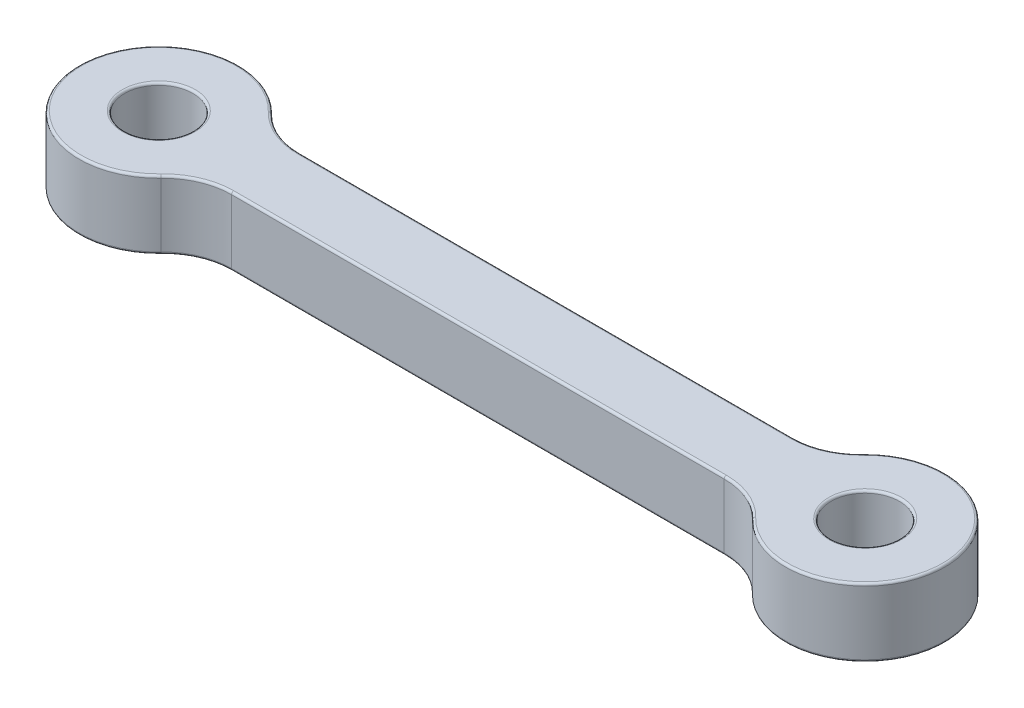
ISO-10303-21;
HEADER;
FILE_DESCRIPTION(('STEP AP214'),'2;1');
FILE_NAME('part.step','',(''),(''),'','','');
FILE_SCHEMA(('AUTOMOTIVE_DESIGN { 1 0 10303 214 1 1 1 1 }'));
ENDSEC;
DATA;
#1=APPLICATION_CONTEXT('core data for automotive mechanical design processes');
#2=APPLICATION_PROTOCOL_DEFINITION('international standard','automotive_design',2000,#1);
#3=PRODUCT_CONTEXT('',#1,'mechanical');
#4=PRODUCT('Part','Part','',(#3));
#5=PRODUCT_RELATED_PRODUCT_CATEGORY('part','',(#4));
#6=PRODUCT_DEFINITION_FORMATION('','',#4);
#7=PRODUCT_DEFINITION_CONTEXT('part definition',#1,'design');
#8=PRODUCT_DEFINITION('design','',#6,#7);
#9=PRODUCT_DEFINITION_SHAPE('','',#8);
#10=(LENGTH_UNIT() NAMED_UNIT(*) SI_UNIT(.MILLI.,.METRE.));
#11=(NAMED_UNIT(*) PLANE_ANGLE_UNIT() SI_UNIT($,.RADIAN.));
#12=(NAMED_UNIT(*) SI_UNIT($,.STERADIAN.) SOLID_ANGLE_UNIT());
#13=UNCERTAINTY_MEASURE_WITH_UNIT(LENGTH_MEASURE(1.E-05),#10,'distance_accuracy_value','');
#14=(GEOMETRIC_REPRESENTATION_CONTEXT(3) GLOBAL_UNCERTAINTY_ASSIGNED_CONTEXT((#13)) GLOBAL_UNIT_ASSIGNED_CONTEXT((#10,
#11,#12)) REPRESENTATION_CONTEXT('',''));
#15=CARTESIAN_POINT('',(0.,0.,0.));
#16=DIRECTION('',(0.,0.,1.));
#17=DIRECTION('',(1.,0.,0.));
#18=AXIS2_PLACEMENT_3D('',#15,#16,#17);
#19=CARTESIAN_POINT('',(0.,3.,-1.5));
#20=DIRECTION('',(0.,0.,-1.));
#21=DIRECTION('',(-1.,0.,0.));
#22=AXIS2_PLACEMENT_3D('',#19,#20,#21);
#23=PLANE('',#22);
#24=DIRECTION('',(0.,-1.,0.));
#25=VECTOR('',#24,1.);
#26=CARTESIAN_POINT('',(26.3095842401766,3.,-1.5));
#27=LINE('',#26,#25);
#28=CARTESIAN_POINT('',(26.3095842401766,2.9,-1.5));
#29=VERTEX_POINT('',#28);
#30=CARTESIAN_POINT('',(26.3095842401766,0.0999999999999998,-1.5));
#31=VERTEX_POINT('',#30);
#32=EDGE_CURVE('E292',#29,#31,#27,.T.);
#33=ORIENTED_EDGE('',*,*,#32,.T.);
#34=DIRECTION('',(1.,0.,0.));
#35=VECTOR('',#34,1.);
#36=CARTESIAN_POINT('',(4.69041575982343,0.1,-1.5));
#37=LINE('',#36,#35);
#38=CARTESIAN_POINT('',(4.69041575982343,0.0999999999999998,-1.5));
#39=VERTEX_POINT('',#38);
#40=EDGE_CURVE('E239',#31,#39,#37,.F.);
#41=ORIENTED_EDGE('',*,*,#40,.T.);
#42=DIRECTION('',(0.,-1.,0.));
#43=VECTOR('',#42,1.);
#44=CARTESIAN_POINT('',(4.69041575982343,3.,-1.5));
#45=LINE('',#44,#43);
#46=CARTESIAN_POINT('',(4.69041575982343,2.9,-1.5));
#47=VERTEX_POINT('',#46);
#48=EDGE_CURVE('E172',#47,#39,#45,.T.);
#49=ORIENTED_EDGE('',*,*,#48,.F.);
#50=DIRECTION('',(1.,0.,0.));
#51=VECTOR('',#50,1.);
#52=CARTESIAN_POINT('',(0.,2.9,-1.5));
#53=LINE('',#52,#51);
#54=EDGE_CURVE('E237',#47,#29,#53,.T.);
#55=ORIENTED_EDGE('',*,*,#54,.T.);
#56=EDGE_LOOP('',(#33,#41,#49,#55));
#57=FACE_BOUND('',#56,.T.);
#58=ADVANCED_FACE('F36',(#57),#23,.T.);
#59=CARTESIAN_POINT('',(4.69041575982343,3.,-4.5));
#60=DIRECTION('',(0.,-1.,0.));
#61=DIRECTION('',(0.,0.,-1.));
#62=AXIS2_PLACEMENT_3D('',#59,#60,#61);
#63=CYLINDRICAL_SURFACE('',#62,3.);
#64=ORIENTED_EDGE('',*,*,#48,.T.);
#65=CARTESIAN_POINT('',(4.69041575982343,0.0999999999999998,-4.5));
#66=DIRECTION('',(0.,1.,0.));
#67=DIRECTION('',(0.,0.,1.));
#68=AXIS2_PLACEMENT_3D('',#65,#66,#67);
#69=CIRCLE('',#68,3.);
#70=CARTESIAN_POINT('',(2.52560848605877,0.0999999999999998,-2.42307692307692));
#71=VERTEX_POINT('',#70);
#72=EDGE_CURVE('E171',#39,#71,#69,.F.);
#73=ORIENTED_EDGE('',*,*,#72,.T.);
#74=DIRECTION('',(0.,-1.,0.));
#75=VECTOR('',#74,1.);
#76=CARTESIAN_POINT('',(2.52560848605877,3.,-2.42307692307692));
#77=LINE('',#76,#75);
#78=CARTESIAN_POINT('',(2.52560848605877,2.9,-2.42307692307692));
#79=VERTEX_POINT('',#78);
#80=EDGE_CURVE('E153',#79,#71,#77,.T.);
#81=ORIENTED_EDGE('',*,*,#80,.F.);
#82=CARTESIAN_POINT('',(4.69041575982343,2.9,-4.5));
#83=DIRECTION('',(0.,1.,0.));
#84=DIRECTION('',(0.,0.,1.));
#85=AXIS2_PLACEMENT_3D('',#82,#83,#84);
#86=CIRCLE('',#85,3.);
#87=EDGE_CURVE('E168',#79,#47,#86,.T.);
#88=ORIENTED_EDGE('',*,*,#87,.T.);
#89=EDGE_LOOP('',(#64,#73,#81,#88));
#90=FACE_BOUND('',#89,.T.);
#91=ADVANCED_FACE('F166',(#90),#63,.F.);
#92=CARTESIAN_POINT('',(0.,3.,0.));
#93=DIRECTION('',(0.,-1.,0.));
#94=DIRECTION('',(0.,0.,-1.));
#95=AXIS2_PLACEMENT_3D('',#92,#93,#94);
#96=CYLINDRICAL_SURFACE('',#95,3.5);
#97=ORIENTED_EDGE('',*,*,#80,.T.);
#98=CARTESIAN_POINT('',(0.,0.0999999999999998,0.));
#99=DIRECTION('',(0.,1.,0.));
#100=DIRECTION('',(0.,0.,1.));
#101=AXIS2_PLACEMENT_3D('',#98,#99,#100);
#102=CIRCLE('',#101,3.5);
#103=CARTESIAN_POINT('',(2.52560848605877,0.0999999999999998,2.42307692307692));
#104=VERTEX_POINT('',#103);
#105=EDGE_CURVE('E160',#71,#104,#102,.T.);
#106=ORIENTED_EDGE('',*,*,#105,.T.);
#107=DIRECTION('',(0.,-1.,0.));
#108=VECTOR('',#107,1.);
#109=CARTESIAN_POINT('',(2.52560848605877,3.,2.42307692307692));
#110=LINE('',#109,#108);
#111=CARTESIAN_POINT('',(2.52560848605877,2.9,2.42307692307692));
#112=VERTEX_POINT('',#111);
#113=EDGE_CURVE('E155',#112,#104,#110,.T.);
#114=ORIENTED_EDGE('',*,*,#113,.F.);
#115=CARTESIAN_POINT('',(0.,2.9,0.));
#116=DIRECTION('',(0.,1.,0.));
#117=DIRECTION('',(0.,0.,1.));
#118=AXIS2_PLACEMENT_3D('',#115,#116,#117);
#119=CIRCLE('',#118,3.5);
#120=EDGE_CURVE('E150',#112,#79,#119,.F.);
#121=ORIENTED_EDGE('',*,*,#120,.T.);
#122=EDGE_LOOP('',(#97,#106,#114,#121));
#123=FACE_BOUND('',#122,.T.);
#124=ADVANCED_FACE('F152',(#123),#96,.T.);
#125=CARTESIAN_POINT('',(4.69041575982343,3.,4.5));
#126=DIRECTION('',(0.,-1.,0.));
#127=DIRECTION('',(0.,0.,-1.));
#128=AXIS2_PLACEMENT_3D('',#125,#126,#127);
#129=CYLINDRICAL_SURFACE('',#128,3.);
#130=ORIENTED_EDGE('',*,*,#113,.T.);
#131=CARTESIAN_POINT('',(4.69041575982343,0.0999999999999998,4.5));
#132=DIRECTION('',(0.,1.,0.));
#133=DIRECTION('',(0.,0.,1.));
#134=AXIS2_PLACEMENT_3D('',#131,#132,#133);
#135=CIRCLE('',#134,3.);
#136=CARTESIAN_POINT('',(4.69041575982343,0.0999999999999998,1.5));
#137=VERTEX_POINT('',#136);
#138=EDGE_CURVE('E218',#104,#137,#135,.F.);
#139=ORIENTED_EDGE('',*,*,#138,.T.);
#140=DIRECTION('',(0.,-1.,0.));
#141=VECTOR('',#140,1.);
#142=CARTESIAN_POINT('',(4.69041575982343,3.,1.5));
#143=LINE('',#142,#141);
#144=CARTESIAN_POINT('',(4.69041575982343,2.9,1.5));
#145=VERTEX_POINT('',#144);
#146=EDGE_CURVE('E338',#145,#137,#143,.T.);
#147=ORIENTED_EDGE('',*,*,#146,.F.);
#148=CARTESIAN_POINT('',(4.69041575982343,2.9,4.5));
#149=DIRECTION('',(0.,1.,0.));
#150=DIRECTION('',(0.,0.,1.));
#151=AXIS2_PLACEMENT_3D('',#148,#149,#150);
#152=CIRCLE('',#151,3.);
#153=EDGE_CURVE('E216',#145,#112,#152,.T.);
#154=ORIENTED_EDGE('',*,*,#153,.T.);
#155=EDGE_LOOP('',(#130,#139,#147,#154));
#156=FACE_BOUND('',#155,.T.);
#157=ADVANCED_FACE('F343',(#156),#129,.F.);
#158=CARTESIAN_POINT('',(0.,3.,1.5));
#159=DIRECTION('',(0.,0.,-1.));
#160=DIRECTION('',(-1.,0.,0.));
#161=AXIS2_PLACEMENT_3D('',#158,#159,#160);
#162=PLANE('',#161);
#163=ORIENTED_EDGE('',*,*,#146,.T.);
#164=DIRECTION('',(1.,0.,0.));
#165=VECTOR('',#164,1.);
#166=CARTESIAN_POINT('',(0.,0.0999999999999998,1.5));
#167=LINE('',#166,#165);
#168=CARTESIAN_POINT('',(26.3095842401766,0.0999999999999998,1.5));
#169=VERTEX_POINT('',#168);
#170=EDGE_CURVE('E222',#137,#169,#167,.T.);
#171=ORIENTED_EDGE('',*,*,#170,.T.);
#172=DIRECTION('',(0.,-1.,0.));
#173=VECTOR('',#172,1.);
#174=CARTESIAN_POINT('',(26.3095842401766,3.,1.5));
#175=LINE('',#174,#173);
#176=CARTESIAN_POINT('',(26.3095842401766,2.9,1.5));
#177=VERTEX_POINT('',#176);
#178=EDGE_CURVE('E335',#177,#169,#175,.T.);
#179=ORIENTED_EDGE('',*,*,#178,.F.);
#180=DIRECTION('',(1.,0.,0.));
#181=VECTOR('',#180,1.);
#182=CARTESIAN_POINT('',(4.69041575982343,2.9,1.5));
#183=LINE('',#182,#181);
#184=EDGE_CURVE('E220',#177,#145,#183,.F.);
#185=ORIENTED_EDGE('',*,*,#184,.T.);
#186=EDGE_LOOP('',(#163,#171,#179,#185));
#187=FACE_BOUND('',#186,.T.);
#188=ADVANCED_FACE('F386',(#187),#162,.F.);
#189=CARTESIAN_POINT('',(26.3095842401766,3.,4.5));
#190=DIRECTION('',(0.,-1.,0.));
#191=DIRECTION('',(0.,0.,-1.));
#192=AXIS2_PLACEMENT_3D('',#189,#190,#191);
#193=CYLINDRICAL_SURFACE('',#192,3.);
#194=ORIENTED_EDGE('',*,*,#178,.T.);
#195=CARTESIAN_POINT('',(26.3095842401766,0.0999999999999998,4.5));
#196=DIRECTION('',(0.,1.,0.));
#197=DIRECTION('',(0.,0.,1.));
#198=AXIS2_PLACEMENT_3D('',#195,#196,#197);
#199=CIRCLE('',#198,3.);
#200=CARTESIAN_POINT('',(28.4743915139412,0.0999999999999998,2.42307692307692));
#201=VERTEX_POINT('',#200);
#202=EDGE_CURVE('E226',#169,#201,#199,.F.);
#203=ORIENTED_EDGE('',*,*,#202,.T.);
#204=DIRECTION('',(0.,-1.,0.));
#205=VECTOR('',#204,1.);
#206=CARTESIAN_POINT('',(28.4743915139412,3.,2.42307692307692));
#207=LINE('',#206,#205);
#208=CARTESIAN_POINT('',(28.4743915139412,2.9,2.42307692307692));
#209=VERTEX_POINT('',#208);
#210=EDGE_CURVE('E330',#209,#201,#207,.T.);
#211=ORIENTED_EDGE('',*,*,#210,.F.);
#212=CARTESIAN_POINT('',(26.3095842401766,2.9,4.5));
#213=DIRECTION('',(0.,1.,0.));
#214=DIRECTION('',(0.,0.,1.));
#215=AXIS2_PLACEMENT_3D('',#212,#213,#214);
#216=CIRCLE('',#215,3.);
#217=EDGE_CURVE('E224',#209,#177,#216,.T.);
#218=ORIENTED_EDGE('',*,*,#217,.T.);
#219=EDGE_LOOP('',(#194,#203,#211,#218));
#220=FACE_BOUND('',#219,.T.);
#221=ADVANCED_FACE('F388',(#220),#193,.F.);
#222=CARTESIAN_POINT('',(31.,3.,0.));
#223=DIRECTION('',(0.,-1.,0.));
#224=DIRECTION('',(0.,0.,-1.));
#225=AXIS2_PLACEMENT_3D('',#222,#223,#224);
#226=CYLINDRICAL_SURFACE('',#225,3.5);
#227=ORIENTED_EDGE('',*,*,#210,.T.);
#228=CARTESIAN_POINT('',(31.,0.0999999999999998,0.));
#229=DIRECTION('',(0.,1.,0.));
#230=DIRECTION('',(0.,0.,1.));
#231=AXIS2_PLACEMENT_3D('',#228,#229,#230);
#232=CIRCLE('',#231,3.5);
#233=CARTESIAN_POINT('',(28.4743915139412,0.0999999999999998,-2.42307692307692));
#234=VERTEX_POINT('',#233);
#235=EDGE_CURVE('E230',#201,#234,#232,.T.);
#236=ORIENTED_EDGE('',*,*,#235,.T.);
#237=DIRECTION('',(0.,-1.,0.));
#238=VECTOR('',#237,1.);
#239=CARTESIAN_POINT('',(28.4743915139412,3.,-2.42307692307692));
#240=LINE('',#239,#238);
#241=CARTESIAN_POINT('',(28.4743915139412,2.9,-2.42307692307692));
#242=VERTEX_POINT('',#241);
#243=EDGE_CURVE('E328',#242,#234,#240,.T.);
#244=ORIENTED_EDGE('',*,*,#243,.F.);
#245=CARTESIAN_POINT('',(31.,2.9,0.));
#246=DIRECTION('',(0.,1.,0.));
#247=DIRECTION('',(0.,0.,1.));
#248=AXIS2_PLACEMENT_3D('',#245,#246,#247);
#249=CIRCLE('',#248,3.5);
#250=EDGE_CURVE('E228',#242,#209,#249,.F.);
#251=ORIENTED_EDGE('',*,*,#250,.T.);
#252=EDGE_LOOP('',(#227,#236,#244,#251));
#253=FACE_BOUND('',#252,.T.);
#254=ADVANCED_FACE('F421',(#253),#226,.T.);
#255=CARTESIAN_POINT('',(31.,3.,0.));
#256=DIRECTION('',(0.,-1.,0.));
#257=DIRECTION('',(0.,0.,-1.));
#258=AXIS2_PLACEMENT_3D('',#255,#256,#257);
#259=CYLINDRICAL_SURFACE('',#258,1.5);
#260=CARTESIAN_POINT('',(31.,0.0999999999999998,0.));
#261=DIRECTION('',(0.,1.,0.));
#262=DIRECTION('',(0.,0.,1.));
#263=AXIS2_PLACEMENT_3D('',#260,#261,#262);
#264=CIRCLE('',#263,1.5);
#265=CARTESIAN_POINT('',(31.,0.0999999999999998,1.5));
#266=VERTEX_POINT('',#265);
#267=EDGE_CURVE('E244',#266,#266,#264,.F.);
#268=ORIENTED_EDGE('',*,*,#267,.T.);
#269=EDGE_LOOP('',(#268));
#270=FACE_BOUND('',#269,.T.);
#271=CARTESIAN_POINT('',(31.,2.9,0.));
#272=DIRECTION('',(0.,1.,0.));
#273=DIRECTION('',(0.,0.,1.));
#274=AXIS2_PLACEMENT_3D('',#271,#272,#273);
#275=CIRCLE('',#274,1.5);
#276=CARTESIAN_POINT('',(31.,2.9,1.5));
#277=VERTEX_POINT('',#276);
#278=EDGE_CURVE('E241',#277,#277,#275,.T.);
#279=ORIENTED_EDGE('',*,*,#278,.T.);
#280=EDGE_LOOP('',(#279));
#281=FACE_BOUND('',#280,.T.);
#282=ADVANCED_FACE('F417',(#270,#281),#259,.F.);
#283=CARTESIAN_POINT('',(0.,3.,0.));
#284=DIRECTION('',(0.,-1.,0.));
#285=DIRECTION('',(0.,0.,-1.));
#286=AXIS2_PLACEMENT_3D('',#283,#284,#285);
#287=CYLINDRICAL_SURFACE('',#286,1.5);
#288=CARTESIAN_POINT('',(0.,0.0999999999999998,0.));
#289=DIRECTION('',(0.,1.,0.));
#290=DIRECTION('',(0.,0.,1.));
#291=AXIS2_PLACEMENT_3D('',#288,#289,#290);
#292=CIRCLE('',#291,1.5);
#293=CARTESIAN_POINT('',(0.,0.0999999999999998,1.5));
#294=VERTEX_POINT('',#293);
#295=EDGE_CURVE('E250',#294,#294,#292,.F.);
#296=ORIENTED_EDGE('',*,*,#295,.T.);
#297=EDGE_LOOP('',(#296));
#298=FACE_BOUND('',#297,.T.);
#299=CARTESIAN_POINT('',(0.,2.9,0.));
#300=DIRECTION('',(0.,1.,0.));
#301=DIRECTION('',(0.,0.,1.));
#302=AXIS2_PLACEMENT_3D('',#299,#300,#301);
#303=CIRCLE('',#302,1.5);
#304=CARTESIAN_POINT('',(0.,2.9,1.5));
#305=VERTEX_POINT('',#304);
#306=EDGE_CURVE('E247',#305,#305,#303,.T.);
#307=ORIENTED_EDGE('',*,*,#306,.T.);
#308=EDGE_LOOP('',(#307));
#309=FACE_BOUND('',#308,.T.);
#310=ADVANCED_FACE('F420',(#298,#309),#287,.F.);
#311=CARTESIAN_POINT('',(26.3095842401766,3.,-4.5));
#312=DIRECTION('',(0.,-1.,0.));
#313=DIRECTION('',(0.,0.,-1.));
#314=AXIS2_PLACEMENT_3D('',#311,#312,#313);
#315=CYLINDRICAL_SURFACE('',#314,3.);
#316=ORIENTED_EDGE('',*,*,#243,.T.);
#317=CARTESIAN_POINT('',(26.3095842401766,0.0999999999999998,-4.5));
#318=DIRECTION('',(0.,1.,0.));
#319=DIRECTION('',(0.,0.,1.));
#320=AXIS2_PLACEMENT_3D('',#317,#318,#319);
#321=CIRCLE('',#320,3.);
#322=EDGE_CURVE('E235',#234,#31,#321,.F.);
#323=ORIENTED_EDGE('',*,*,#322,.T.);
#324=ORIENTED_EDGE('',*,*,#32,.F.);
#325=CARTESIAN_POINT('',(26.3095842401766,2.9,-4.5));
#326=DIRECTION('',(0.,1.,0.));
#327=DIRECTION('',(0.,0.,1.));
#328=AXIS2_PLACEMENT_3D('',#325,#326,#327);
#329=CIRCLE('',#328,3.);
#330=EDGE_CURVE('E232',#29,#242,#329,.T.);
#331=ORIENTED_EDGE('',*,*,#330,.T.);
#332=EDGE_LOOP('',(#316,#323,#324,#331));
#333=FACE_BOUND('',#332,.T.);
#334=ADVANCED_FACE('F325',(#333),#315,.F.);
#335=CARTESIAN_POINT('',(0.,3.,0.));
#336=DIRECTION('',(0.,1.,0.));
#337=DIRECTION('',(0.,0.,1.));
#338=AXIS2_PLACEMENT_3D('',#335,#336,#337);
#339=PLANE('',#338);
#340=CARTESIAN_POINT('',(31.,3.,0.));
#341=DIRECTION('',(0.,1.,0.));
#342=DIRECTION('',(0.,0.,1.));
#343=AXIS2_PLACEMENT_3D('',#340,#341,#342);
#344=CIRCLE('',#343,3.4);
#345=CARTESIAN_POINT('',(28.5465517564001,3.,2.35384615384616));
#346=VERTEX_POINT('',#345);
#347=CARTESIAN_POINT('',(28.5465517564001,3.,-2.35384615384616));
#348=VERTEX_POINT('',#347);
#349=EDGE_CURVE('E45',#346,#348,#344,.T.);
#350=ORIENTED_EDGE('',*,*,#349,.T.);
#351=CARTESIAN_POINT('',(26.3095842401766,3.,-4.5));
#352=DIRECTION('',(0.,1.,0.));
#353=DIRECTION('',(0.,0.,1.));
#354=AXIS2_PLACEMENT_3D('',#351,#352,#353);
#355=CIRCLE('',#354,3.1);
#356=CARTESIAN_POINT('',(26.3095842401766,3.,-1.4));
#357=VERTEX_POINT('',#356);
#358=EDGE_CURVE('E11',#348,#357,#355,.F.);
#359=ORIENTED_EDGE('',*,*,#358,.T.);
#360=DIRECTION('',(1.,0.,0.));
#361=VECTOR('',#360,1.);
#362=CARTESIAN_POINT('',(0.,3.,-1.4));
#363=LINE('',#362,#361);
#364=CARTESIAN_POINT('',(4.69041575982343,3.,-1.4));
#365=VERTEX_POINT('',#364);
#366=EDGE_CURVE('E259',#357,#365,#363,.F.);
#367=ORIENTED_EDGE('',*,*,#366,.T.);
#368=CARTESIAN_POINT('',(4.69041575982343,3.,-4.5));
#369=DIRECTION('',(0.,1.,0.));
#370=DIRECTION('',(0.,0.,1.));
#371=AXIS2_PLACEMENT_3D('',#368,#369,#370);
#372=CIRCLE('',#371,3.1);
#373=CARTESIAN_POINT('',(2.45344824359995,3.,-2.35384615384615));
#374=VERTEX_POINT('',#373);
#375=EDGE_CURVE('E261',#365,#374,#372,.F.);
#376=ORIENTED_EDGE('',*,*,#375,.T.);
#377=CARTESIAN_POINT('',(0.,3.,0.));
#378=DIRECTION('',(0.,1.,0.));
#379=DIRECTION('',(0.,0.,1.));
#380=AXIS2_PLACEMENT_3D('',#377,#378,#379);
#381=CIRCLE('',#380,3.4);
#382=CARTESIAN_POINT('',(2.45344824359995,3.,2.35384615384615));
#383=VERTEX_POINT('',#382);
#384=EDGE_CURVE('E178',#374,#383,#381,.T.);
#385=ORIENTED_EDGE('',*,*,#384,.T.);
#386=CARTESIAN_POINT('',(4.69041575982343,3.,4.5));
#387=DIRECTION('',(0.,1.,0.));
#388=DIRECTION('',(0.,0.,1.));
#389=AXIS2_PLACEMENT_3D('',#386,#387,#388);
#390=CIRCLE('',#389,3.1);
#391=CARTESIAN_POINT('',(4.69041575982343,3.,1.4));
#392=VERTEX_POINT('',#391);
#393=EDGE_CURVE('E264',#383,#392,#390,.F.);
#394=ORIENTED_EDGE('',*,*,#393,.T.);
#395=DIRECTION('',(1.,0.,0.));
#396=VECTOR('',#395,1.);
#397=CARTESIAN_POINT('',(26.3095842401766,3.,1.4));
#398=LINE('',#397,#396);
#399=CARTESIAN_POINT('',(26.3095842401766,3.,1.4));
#400=VERTEX_POINT('',#399);
#401=EDGE_CURVE('E266',#392,#400,#398,.T.);
#402=ORIENTED_EDGE('',*,*,#401,.T.);
#403=CARTESIAN_POINT('',(26.3095842401766,3.,4.5));
#404=DIRECTION('',(0.,1.,0.));
#405=DIRECTION('',(0.,0.,1.));
#406=AXIS2_PLACEMENT_3D('',#403,#404,#405);
#407=CIRCLE('',#406,3.1);
#408=EDGE_CURVE('E56',#400,#346,#407,.F.);
#409=ORIENTED_EDGE('',*,*,#408,.T.);
#410=EDGE_LOOP('',(#350,#359,#367,#376,#385,#394,#402,#409));
#411=FACE_BOUND('',#410,.T.);
#412=CARTESIAN_POINT('',(31.,3.,0.));
#413=DIRECTION('',(0.,1.,0.));
#414=DIRECTION('',(0.,0.,1.));
#415=AXIS2_PLACEMENT_3D('',#412,#413,#414);
#416=CIRCLE('',#415,1.6);
#417=CARTESIAN_POINT('',(31.,3.,1.6));
#418=VERTEX_POINT('',#417);
#419=EDGE_CURVE('E256',#418,#418,#416,.F.);
#420=ORIENTED_EDGE('',*,*,#419,.T.);
#421=EDGE_LOOP('',(#420));
#422=FACE_BOUND('',#421,.T.);
#423=CARTESIAN_POINT('',(0.,3.,0.));
#424=DIRECTION('',(0.,1.,0.));
#425=DIRECTION('',(0.,0.,1.));
#426=AXIS2_PLACEMENT_3D('',#423,#424,#425);
#427=CIRCLE('',#426,1.6);
#428=CARTESIAN_POINT('',(0.,3.,1.6));
#429=VERTEX_POINT('',#428);
#430=EDGE_CURVE('E253',#429,#429,#427,.F.);
#431=ORIENTED_EDGE('',*,*,#430,.T.);
#432=EDGE_LOOP('',(#431));
#433=FACE_BOUND('',#432,.T.);
#434=ADVANCED_FACE('F311',(#411,#422,#433),#339,.T.);
#435=CARTESIAN_POINT('',(0.,0.,0.));
#436=DIRECTION('',(0.,1.,0.));
#437=DIRECTION('',(0.,0.,1.));
#438=AXIS2_PLACEMENT_3D('',#435,#436,#437);
#439=PLANE('',#438);
#440=CARTESIAN_POINT('',(0.,0.,0.));
#441=DIRECTION('',(0.,1.,0.));
#442=DIRECTION('',(0.,0.,1.));
#443=AXIS2_PLACEMENT_3D('',#440,#441,#442);
#444=CIRCLE('',#443,3.4);
#445=CARTESIAN_POINT('',(2.45344824359995,0.,2.35384615384615));
#446=VERTEX_POINT('',#445);
#447=CARTESIAN_POINT('',(2.45344824359995,0.,-2.35384615384615));
#448=VERTEX_POINT('',#447);
#449=EDGE_CURVE('E211',#446,#448,#444,.F.);
#450=ORIENTED_EDGE('',*,*,#449,.T.);
#451=CARTESIAN_POINT('',(4.69041575982343,0.,-4.5));
#452=DIRECTION('',(0.,1.,0.));
#453=DIRECTION('',(0.,0.,1.));
#454=AXIS2_PLACEMENT_3D('',#451,#452,#453);
#455=CIRCLE('',#454,3.1);
#456=CARTESIAN_POINT('',(4.69041575982343,0.,-1.4));
#457=VERTEX_POINT('',#456);
#458=EDGE_CURVE('E161',#448,#457,#455,.T.);
#459=ORIENTED_EDGE('',*,*,#458,.T.);
#460=DIRECTION('',(1.,0.,0.));
#461=VECTOR('',#460,1.);
#462=CARTESIAN_POINT('',(26.3095842401766,0.,-1.4));
#463=LINE('',#462,#461);
#464=CARTESIAN_POINT('',(26.3095842401766,0.,-1.4));
#465=VERTEX_POINT('',#464);
#466=EDGE_CURVE('E199',#457,#465,#463,.T.);
#467=ORIENTED_EDGE('',*,*,#466,.T.);
#468=CARTESIAN_POINT('',(26.3095842401766,0.,-4.5));
#469=DIRECTION('',(0.,1.,0.));
#470=DIRECTION('',(0.,0.,1.));
#471=AXIS2_PLACEMENT_3D('',#468,#469,#470);
#472=CIRCLE('',#471,3.1);
#473=CARTESIAN_POINT('',(28.5465517564001,0.,-2.35384615384616));
#474=VERTEX_POINT('',#473);
#475=EDGE_CURVE('E201',#465,#474,#472,.T.);
#476=ORIENTED_EDGE('',*,*,#475,.T.);
#477=CARTESIAN_POINT('',(31.,0.,0.));
#478=DIRECTION('',(0.,1.,0.));
#479=DIRECTION('',(0.,0.,1.));
#480=AXIS2_PLACEMENT_3D('',#477,#478,#479);
#481=CIRCLE('',#480,3.4);
#482=CARTESIAN_POINT('',(28.5465517564001,0.,2.35384615384616));
#483=VERTEX_POINT('',#482);
#484=EDGE_CURVE('E203',#474,#483,#481,.F.);
#485=ORIENTED_EDGE('',*,*,#484,.T.);
#486=CARTESIAN_POINT('',(26.3095842401766,0.,4.5));
#487=DIRECTION('',(0.,1.,0.));
#488=DIRECTION('',(0.,0.,1.));
#489=AXIS2_PLACEMENT_3D('',#486,#487,#488);
#490=CIRCLE('',#489,3.1);
#491=CARTESIAN_POINT('',(26.3095842401766,0.,1.4));
#492=VERTEX_POINT('',#491);
#493=EDGE_CURVE('E205',#483,#492,#490,.T.);
#494=ORIENTED_EDGE('',*,*,#493,.T.);
#495=DIRECTION('',(1.,0.,0.));
#496=VECTOR('',#495,1.);
#497=CARTESIAN_POINT('',(0.,0.,1.4));
#498=LINE('',#497,#496);
#499=CARTESIAN_POINT('',(4.69041575982343,0.,1.4));
#500=VERTEX_POINT('',#499);
#501=EDGE_CURVE('E207',#492,#500,#498,.F.);
#502=ORIENTED_EDGE('',*,*,#501,.T.);
#503=CARTESIAN_POINT('',(4.69041575982343,0.,4.5));
#504=DIRECTION('',(0.,1.,0.));
#505=DIRECTION('',(0.,0.,1.));
#506=AXIS2_PLACEMENT_3D('',#503,#504,#505);
#507=CIRCLE('',#506,3.1);
#508=EDGE_CURVE('E209',#500,#446,#507,.T.);
#509=ORIENTED_EDGE('',*,*,#508,.T.);
#510=EDGE_LOOP('',(#450,#459,#467,#476,#485,#494,#502,#509));
#511=FACE_BOUND('',#510,.T.);
#512=CARTESIAN_POINT('',(31.,0.,0.));
#513=DIRECTION('',(0.,1.,0.));
#514=DIRECTION('',(0.,0.,1.));
#515=AXIS2_PLACEMENT_3D('',#512,#513,#514);
#516=CIRCLE('',#515,1.6);
#517=CARTESIAN_POINT('',(31.,0.,1.6));
#518=VERTEX_POINT('',#517);
#519=EDGE_CURVE('E196',#518,#518,#516,.T.);
#520=ORIENTED_EDGE('',*,*,#519,.T.);
#521=EDGE_LOOP('',(#520));
#522=FACE_BOUND('',#521,.T.);
#523=CARTESIAN_POINT('',(0.,0.,0.));
#524=DIRECTION('',(0.,1.,0.));
#525=DIRECTION('',(0.,0.,1.));
#526=AXIS2_PLACEMENT_3D('',#523,#524,#525);
#527=CIRCLE('',#526,1.6);
#528=CARTESIAN_POINT('',(0.,0.,1.6));
#529=VERTEX_POINT('',#528);
#530=EDGE_CURVE('E190',#529,#529,#527,.T.);
#531=ORIENTED_EDGE('',*,*,#530,.T.);
#532=EDGE_LOOP('',(#531));
#533=FACE_BOUND('',#532,.T.);
#534=ADVANCED_FACE('F357',(#511,#522,#533),#439,.F.);
#535=CARTESIAN_POINT('',(26.3095842401766,0.0999999999999998,4.5));
#536=DIRECTION('',(0.,1.,0.));
#537=DIRECTION('',(0.,0.,1.));
#538=AXIS2_PLACEMENT_3D('',#535,#536,#537);
#539=TOROIDAL_SURFACE('',#538,3.1,0.1);
#540=CARTESIAN_POINT('',(26.3095842401766,0.1,1.4));
#541=DIRECTION('',(-1.,0.,0.));
#542=DIRECTION('',(0.,0.,1.));
#543=AXIS2_PLACEMENT_3D('',#540,#541,#542);
#544=CIRCLE('',#543,0.1);
#545=EDGE_CURVE('E286',#492,#169,#544,.T.);
#546=ORIENTED_EDGE('',*,*,#545,.F.);
#547=ORIENTED_EDGE('',*,*,#493,.F.);
#548=CARTESIAN_POINT('',(28.5465517564001,0.0999999999999998,2.35384615384615));
#549=DIRECTION('',(0.692307692307693,0.,0.72160242458822));
#550=DIRECTION('',(0.72160242458822,0.,-0.692307692307693));
#551=AXIS2_PLACEMENT_3D('',#548,#549,#550);
#552=CIRCLE('',#551,0.1);
#553=EDGE_CURVE('E289',#201,#483,#552,.T.);
#554=ORIENTED_EDGE('',*,*,#553,.F.);
#555=ORIENTED_EDGE('',*,*,#202,.F.);
#556=EDGE_LOOP('',(#546,#547,#554,#555));
#557=FACE_BOUND('',#556,.T.);
#558=ADVANCED_FACE('F378',(#557),#539,.T.);
#559=CARTESIAN_POINT('',(31.,0.0999999999999998,0.));
#560=DIRECTION('',(0.,1.,0.));
#561=DIRECTION('',(0.,0.,1.));
#562=AXIS2_PLACEMENT_3D('',#559,#560,#561);
#563=TOROIDAL_SURFACE('',#562,3.4,0.1);
#564=ORIENTED_EDGE('',*,*,#553,.T.);
#565=ORIENTED_EDGE('',*,*,#484,.F.);
#566=CARTESIAN_POINT('',(28.5465517564001,0.0999999999999998,-2.35384615384615));
#567=DIRECTION('',(-0.692307692307693,0.,0.72160242458822));
#568=DIRECTION('',(0.72160242458822,0.,0.692307692307693));
#569=AXIS2_PLACEMENT_3D('',#566,#567,#568);
#570=CIRCLE('',#569,0.1);
#571=EDGE_CURVE('E283',#234,#474,#570,.T.);
#572=ORIENTED_EDGE('',*,*,#571,.F.);
#573=ORIENTED_EDGE('',*,*,#235,.F.);
#574=EDGE_LOOP('',(#564,#565,#572,#573));
#575=FACE_BOUND('',#574,.T.);
#576=ADVANCED_FACE('F373',(#575),#563,.T.);
#577=CARTESIAN_POINT('',(0.,0.0999999999999998,1.4));
#578=DIRECTION('',(1.,0.,0.));
#579=DIRECTION('',(0.,0.,-1.));
#580=AXIS2_PLACEMENT_3D('',#577,#578,#579);
#581=CYLINDRICAL_SURFACE('',#580,0.1);
#582=ORIENTED_EDGE('',*,*,#545,.T.);
#583=ORIENTED_EDGE('',*,*,#170,.F.);
#584=CARTESIAN_POINT('',(4.69041575982343,0.1,1.4));
#585=DIRECTION('',(-1.,0.,0.));
#586=DIRECTION('',(0.,0.,1.));
#587=AXIS2_PLACEMENT_3D('',#584,#585,#586);
#588=CIRCLE('',#587,0.1);
#589=EDGE_CURVE('E280',#500,#137,#588,.T.);
#590=ORIENTED_EDGE('',*,*,#589,.F.);
#591=ORIENTED_EDGE('',*,*,#501,.F.);
#592=EDGE_LOOP('',(#582,#583,#590,#591));
#593=FACE_BOUND('',#592,.T.);
#594=ADVANCED_FACE('F383',(#593),#581,.T.);
#595=CARTESIAN_POINT('',(26.3095842401766,0.0999999999999998,-4.5));
#596=DIRECTION('',(0.,1.,0.));
#597=DIRECTION('',(0.,0.,1.));
#598=AXIS2_PLACEMENT_3D('',#595,#596,#597);
#599=TOROIDAL_SURFACE('',#598,3.1,0.1);
#600=ORIENTED_EDGE('',*,*,#571,.T.);
#601=ORIENTED_EDGE('',*,*,#475,.F.);
#602=CARTESIAN_POINT('',(26.3095842401766,0.0999999999999998,-1.4));
#603=DIRECTION('',(-1.,0.,0.));
#604=DIRECTION('',(0.,0.,1.));
#605=AXIS2_PLACEMENT_3D('',#602,#603,#604);
#606=CIRCLE('',#605,0.1);
#607=EDGE_CURVE('E277',#31,#465,#606,.T.);
#608=ORIENTED_EDGE('',*,*,#607,.F.);
#609=ORIENTED_EDGE('',*,*,#322,.F.);
#610=EDGE_LOOP('',(#600,#601,#608,#609));
#611=FACE_BOUND('',#610,.T.);
#612=ADVANCED_FACE('F369',(#611),#599,.T.);
#613=CARTESIAN_POINT('',(4.69041575982343,0.0999999999999998,4.5));
#614=DIRECTION('',(0.,1.,0.));
#615=DIRECTION('',(0.,0.,1.));
#616=AXIS2_PLACEMENT_3D('',#613,#614,#615);
#617=TOROIDAL_SURFACE('',#616,3.1,0.1);
#618=ORIENTED_EDGE('',*,*,#589,.T.);
#619=ORIENTED_EDGE('',*,*,#138,.F.);
#620=CARTESIAN_POINT('',(2.45344824359995,0.1,2.35384615384615));
#621=DIRECTION('',(-0.692307692307693,0.,0.72160242458822));
#622=DIRECTION('',(0.72160242458822,0.,0.692307692307693));
#623=AXIS2_PLACEMENT_3D('',#620,#621,#622);
#624=CIRCLE('',#623,0.1);
#625=EDGE_CURVE('E274',#446,#104,#624,.T.);
#626=ORIENTED_EDGE('',*,*,#625,.F.);
#627=ORIENTED_EDGE('',*,*,#508,.F.);
#628=EDGE_LOOP('',(#618,#619,#626,#627));
#629=FACE_BOUND('',#628,.T.);
#630=ADVANCED_FACE('F347',(#629),#617,.T.);
#631=CARTESIAN_POINT('',(0.,0.1,-1.4));
#632=DIRECTION('',(-1.,0.,0.));
#633=DIRECTION('',(0.,0.,1.));
#634=AXIS2_PLACEMENT_3D('',#631,#632,#633);
#635=CYLINDRICAL_SURFACE('',#634,0.1);
#636=ORIENTED_EDGE('',*,*,#607,.T.);
#637=ORIENTED_EDGE('',*,*,#466,.F.);
#638=CARTESIAN_POINT('',(4.69041575982343,0.1,-1.4));
#639=DIRECTION('',(-1.,0.,0.));
#640=DIRECTION('',(0.,0.,1.));
#641=AXIS2_PLACEMENT_3D('',#638,#639,#640);
#642=CIRCLE('',#641,0.1);
#643=EDGE_CURVE('E272',#39,#457,#642,.T.);
#644=ORIENTED_EDGE('',*,*,#643,.F.);
#645=ORIENTED_EDGE('',*,*,#40,.F.);
#646=EDGE_LOOP('',(#636,#637,#644,#645));
#647=FACE_BOUND('',#646,.T.);
#648=ADVANCED_FACE('F365',(#647),#635,.T.);
#649=CARTESIAN_POINT('',(0.,0.0999999999999998,0.));
#650=DIRECTION('',(0.,1.,0.));
#651=DIRECTION('',(0.,0.,1.));
#652=AXIS2_PLACEMENT_3D('',#649,#650,#651);
#653=TOROIDAL_SURFACE('',#652,3.4,0.1);
#654=ORIENTED_EDGE('',*,*,#625,.T.);
#655=ORIENTED_EDGE('',*,*,#105,.F.);
#656=CARTESIAN_POINT('',(2.45344824359995,0.1,-2.35384615384615));
#657=DIRECTION('',(0.692307692307693,0.,0.72160242458822));
#658=DIRECTION('',(0.72160242458822,0.,-0.692307692307693));
#659=AXIS2_PLACEMENT_3D('',#656,#657,#658);
#660=CIRCLE('',#659,0.1);
#661=EDGE_CURVE('E270',#448,#71,#660,.T.);
#662=ORIENTED_EDGE('',*,*,#661,.F.);
#663=ORIENTED_EDGE('',*,*,#449,.F.);
#664=EDGE_LOOP('',(#654,#655,#662,#663));
#665=FACE_BOUND('',#664,.T.);
#666=ADVANCED_FACE('F353',(#665),#653,.T.);
#667=CARTESIAN_POINT('',(4.69041575982343,0.0999999999999998,-4.5));
#668=DIRECTION('',(0.,1.,0.));
#669=DIRECTION('',(0.,0.,1.));
#670=AXIS2_PLACEMENT_3D('',#667,#668,#669);
#671=TOROIDAL_SURFACE('',#670,3.1,0.1);
#672=ORIENTED_EDGE('',*,*,#643,.T.);
#673=ORIENTED_EDGE('',*,*,#458,.F.);
#674=ORIENTED_EDGE('',*,*,#661,.T.);
#675=ORIENTED_EDGE('',*,*,#72,.F.);
#676=EDGE_LOOP('',(#672,#673,#674,#675));
#677=FACE_BOUND('',#676,.T.);
#678=ADVANCED_FACE('F360',(#677),#671,.T.);
#679=CARTESIAN_POINT('',(31.,0.0999999999999998,0.));
#680=DIRECTION('',(0.,1.,0.));
#681=DIRECTION('',(0.,0.,1.));
#682=AXIS2_PLACEMENT_3D('',#679,#680,#681);
#683=TOROIDAL_SURFACE('',#682,1.6,0.1);
#684=ORIENTED_EDGE('',*,*,#267,.F.);
#685=EDGE_LOOP('',(#684));
#686=FACE_BOUND('',#685,.T.);
#687=ORIENTED_EDGE('',*,*,#519,.F.);
#688=EDGE_LOOP('',(#687));
#689=FACE_BOUND('',#688,.T.);
#690=ADVANCED_FACE('F428',(#686,#689),#683,.T.);
#691=CARTESIAN_POINT('',(0.,0.0999999999999998,0.));
#692=DIRECTION('',(0.,1.,0.));
#693=DIRECTION('',(0.,0.,1.));
#694=AXIS2_PLACEMENT_3D('',#691,#692,#693);
#695=TOROIDAL_SURFACE('',#694,1.6,0.1);
#696=ORIENTED_EDGE('',*,*,#295,.F.);
#697=EDGE_LOOP('',(#696));
#698=FACE_BOUND('',#697,.T.);
#699=ORIENTED_EDGE('',*,*,#530,.F.);
#700=EDGE_LOOP('',(#699));
#701=FACE_BOUND('',#700,.T.);
#702=ADVANCED_FACE('F444',(#698,#701),#695,.T.);
#703=CARTESIAN_POINT('',(4.69041575982343,2.9,4.5));
#704=DIRECTION('',(0.,1.,0.));
#705=DIRECTION('',(0.,0.,1.));
#706=AXIS2_PLACEMENT_3D('',#703,#704,#705);
#707=TOROIDAL_SURFACE('',#706,3.1,0.1);
#708=CARTESIAN_POINT('',(4.69041575982343,2.9,1.4));
#709=DIRECTION('',(1.,0.,0.));
#710=DIRECTION('',(0.,0.,-1.));
#711=AXIS2_PLACEMENT_3D('',#708,#709,#710);
#712=CIRCLE('',#711,0.1);
#713=EDGE_CURVE('E181',#392,#145,#712,.T.);
#714=ORIENTED_EDGE('',*,*,#713,.F.);
#715=ORIENTED_EDGE('',*,*,#393,.F.);
#716=CARTESIAN_POINT('',(2.45344824359995,2.9,2.35384615384615));
#717=DIRECTION('',(-0.692307692307693,0.,0.72160242458822));
#718=DIRECTION('',(0.72160242458822,0.,0.692307692307693));
#719=AXIS2_PLACEMENT_3D('',#716,#717,#718);
#720=CIRCLE('',#719,0.1);
#721=EDGE_CURVE('E40',#112,#383,#720,.T.);
#722=ORIENTED_EDGE('',*,*,#721,.F.);
#723=ORIENTED_EDGE('',*,*,#153,.F.);
#724=EDGE_LOOP('',(#714,#715,#722,#723));
#725=FACE_BOUND('',#724,.T.);
#726=ADVANCED_FACE('F310',(#725),#707,.T.);
#727=CARTESIAN_POINT('',(0.,2.9,0.));
#728=DIRECTION('',(0.,1.,0.));
#729=DIRECTION('',(0.,0.,1.));
#730=AXIS2_PLACEMENT_3D('',#727,#728,#729);
#731=TOROIDAL_SURFACE('',#730,3.4,0.1);
#732=ORIENTED_EDGE('',*,*,#721,.T.);
#733=ORIENTED_EDGE('',*,*,#384,.F.);
#734=CARTESIAN_POINT('',(2.45344824359995,2.9,-2.35384615384615));
#735=DIRECTION('',(0.692307692307693,0.,0.72160242458822));
#736=DIRECTION('',(0.72160242458822,0.,-0.692307692307693));
#737=AXIS2_PLACEMENT_3D('',#734,#735,#736);
#738=CIRCLE('',#737,0.1);
#739=EDGE_CURVE('E176',#79,#374,#738,.T.);
#740=ORIENTED_EDGE('',*,*,#739,.F.);
#741=ORIENTED_EDGE('',*,*,#120,.F.);
#742=EDGE_LOOP('',(#732,#733,#740,#741));
#743=FACE_BOUND('',#742,.T.);
#744=ADVANCED_FACE('F177',(#743),#731,.T.);
#745=CARTESIAN_POINT('',(0.,2.9,1.4));
#746=DIRECTION('',(-1.,0.,0.));
#747=DIRECTION('',(0.,0.,1.));
#748=AXIS2_PLACEMENT_3D('',#745,#746,#747);
#749=CYLINDRICAL_SURFACE('',#748,0.1);
#750=ORIENTED_EDGE('',*,*,#713,.T.);
#751=ORIENTED_EDGE('',*,*,#184,.F.);
#752=CARTESIAN_POINT('',(26.3095842401766,2.9,1.4));
#753=DIRECTION('',(1.,0.,0.));
#754=DIRECTION('',(0.,0.,-1.));
#755=AXIS2_PLACEMENT_3D('',#752,#753,#754);
#756=CIRCLE('',#755,0.1);
#757=EDGE_CURVE('E182',#400,#177,#756,.T.);
#758=ORIENTED_EDGE('',*,*,#757,.F.);
#759=ORIENTED_EDGE('',*,*,#401,.F.);
#760=EDGE_LOOP('',(#750,#751,#758,#759));
#761=FACE_BOUND('',#760,.T.);
#762=ADVANCED_FACE('F587',(#761),#749,.T.);
#763=CARTESIAN_POINT('',(4.69041575982343,2.9,-4.5));
#764=DIRECTION('',(0.,1.,0.));
#765=DIRECTION('',(0.,0.,1.));
#766=AXIS2_PLACEMENT_3D('',#763,#764,#765);
#767=TOROIDAL_SURFACE('',#766,3.1,0.1);
#768=ORIENTED_EDGE('',*,*,#739,.T.);
#769=ORIENTED_EDGE('',*,*,#375,.F.);
#770=CARTESIAN_POINT('',(4.69041575982343,2.9,-1.4));
#771=DIRECTION('',(1.,0.,0.));
#772=DIRECTION('',(0.,0.,-1.));
#773=AXIS2_PLACEMENT_3D('',#770,#771,#772);
#774=CIRCLE('',#773,0.1);
#775=EDGE_CURVE('E187',#47,#365,#774,.T.);
#776=ORIENTED_EDGE('',*,*,#775,.F.);
#777=ORIENTED_EDGE('',*,*,#87,.F.);
#778=EDGE_LOOP('',(#768,#769,#776,#777));
#779=FACE_BOUND('',#778,.T.);
#780=ADVANCED_FACE('F185',(#779),#767,.T.);
#781=CARTESIAN_POINT('',(26.3095842401766,2.9,4.5));
#782=DIRECTION('',(0.,1.,0.));
#783=DIRECTION('',(0.,0.,1.));
#784=AXIS2_PLACEMENT_3D('',#781,#782,#783);
#785=TOROIDAL_SURFACE('',#784,3.1,0.1);
#786=ORIENTED_EDGE('',*,*,#757,.T.);
#787=ORIENTED_EDGE('',*,*,#217,.F.);
#788=CARTESIAN_POINT('',(28.5465517564001,2.9,2.35384615384616));
#789=DIRECTION('',(0.69230769230769,0.,0.721602424588222));
#790=DIRECTION('',(0.721602424588222,0.,-0.69230769230769));
#791=AXIS2_PLACEMENT_3D('',#788,#789,#790);
#792=CIRCLE('',#791,0.1);
#793=EDGE_CURVE('E297',#346,#209,#792,.T.);
#794=ORIENTED_EDGE('',*,*,#793,.F.);
#795=ORIENTED_EDGE('',*,*,#408,.F.);
#796=EDGE_LOOP('',(#786,#787,#794,#795));
#797=FACE_BOUND('',#796,.T.);
#798=ADVANCED_FACE('F392',(#797),#785,.T.);
#799=CARTESIAN_POINT('',(0.,2.9,-1.4));
#800=DIRECTION('',(1.,0.,0.));
#801=DIRECTION('',(0.,0.,-1.));
#802=AXIS2_PLACEMENT_3D('',#799,#800,#801);
#803=CYLINDRICAL_SURFACE('',#802,0.1);
#804=ORIENTED_EDGE('',*,*,#775,.T.);
#805=ORIENTED_EDGE('',*,*,#366,.F.);
#806=CARTESIAN_POINT('',(26.3095842401766,2.9,-1.4));
#807=DIRECTION('',(1.,0.,0.));
#808=DIRECTION('',(0.,0.,-1.));
#809=AXIS2_PLACEMENT_3D('',#806,#807,#808);
#810=CIRCLE('',#809,0.1);
#811=EDGE_CURVE('E295',#29,#357,#810,.T.);
#812=ORIENTED_EDGE('',*,*,#811,.F.);
#813=ORIENTED_EDGE('',*,*,#54,.F.);
#814=EDGE_LOOP('',(#804,#805,#812,#813));
#815=FACE_BOUND('',#814,.T.);
#816=ADVANCED_FACE('F316',(#815),#803,.T.);
#817=CARTESIAN_POINT('',(31.,2.9,0.));
#818=DIRECTION('',(0.,1.,0.));
#819=DIRECTION('',(0.,0.,1.));
#820=AXIS2_PLACEMENT_3D('',#817,#818,#819);
#821=TOROIDAL_SURFACE('',#820,3.4,0.1);
#822=ORIENTED_EDGE('',*,*,#793,.T.);
#823=ORIENTED_EDGE('',*,*,#250,.F.);
#824=CARTESIAN_POINT('',(28.5465517564001,2.9,-2.35384615384616));
#825=DIRECTION('',(-0.69230769230769,0.,0.721602424588222));
#826=DIRECTION('',(0.721602424588222,0.,0.69230769230769));
#827=AXIS2_PLACEMENT_3D('',#824,#825,#826);
#828=CIRCLE('',#827,0.1);
#829=EDGE_CURVE('E293',#348,#242,#828,.T.);
#830=ORIENTED_EDGE('',*,*,#829,.F.);
#831=ORIENTED_EDGE('',*,*,#349,.F.);
#832=EDGE_LOOP('',(#822,#823,#830,#831));
#833=FACE_BOUND('',#832,.T.);
#834=ADVANCED_FACE('F395',(#833),#821,.T.);
#835=CARTESIAN_POINT('',(26.3095842401766,2.9,-4.5));
#836=DIRECTION('',(0.,1.,0.));
#837=DIRECTION('',(0.,0.,1.));
#838=AXIS2_PLACEMENT_3D('',#835,#836,#837);
#839=TOROIDAL_SURFACE('',#838,3.1,0.1);
#840=ORIENTED_EDGE('',*,*,#811,.T.);
#841=ORIENTED_EDGE('',*,*,#358,.F.);
#842=ORIENTED_EDGE('',*,*,#829,.T.);
#843=ORIENTED_EDGE('',*,*,#330,.F.);
#844=EDGE_LOOP('',(#840,#841,#842,#843));
#845=FACE_BOUND('',#844,.T.);
#846=ADVANCED_FACE('F398',(#845),#839,.T.);
#847=CARTESIAN_POINT('',(31.,2.9,0.));
#848=DIRECTION('',(0.,1.,0.));
#849=DIRECTION('',(0.,0.,1.));
#850=AXIS2_PLACEMENT_3D('',#847,#848,#849);
#851=TOROIDAL_SURFACE('',#850,1.6,0.1);
#852=ORIENTED_EDGE('',*,*,#419,.F.);
#853=EDGE_LOOP('',(#852));
#854=FACE_BOUND('',#853,.T.);
#855=ORIENTED_EDGE('',*,*,#278,.F.);
#856=EDGE_LOOP('',(#855));
#857=FACE_BOUND('',#856,.T.);
#858=ADVANCED_FACE('F400',(#854,#857),#851,.T.);
#859=CARTESIAN_POINT('',(0.,2.9,0.));
#860=DIRECTION('',(0.,1.,0.));
#861=DIRECTION('',(0.,0.,1.));
#862=AXIS2_PLACEMENT_3D('',#859,#860,#861);
#863=TOROIDAL_SURFACE('',#862,1.6,0.1);
#864=ORIENTED_EDGE('',*,*,#430,.F.);
#865=EDGE_LOOP('',(#864));
#866=FACE_BOUND('',#865,.T.);
#867=ORIENTED_EDGE('',*,*,#306,.F.);
#868=EDGE_LOOP('',(#867));
#869=FACE_BOUND('',#868,.T.);
#870=ADVANCED_FACE('F38',(#866,#869),#863,.T.);
#871=CLOSED_SHELL('',(#58,#91,#124,#157,#188,#221,#254,#282,#310,#334,#434,#534,#558,#576,#594,
#612,#630,#648,#666,#678,#690,#702,#726,#744,#762,#780,#798,#816,#834,#846,#858,#870));
#872=MANIFOLD_SOLID_BREP('B2',#871);
#873=ADVANCED_BREP_SHAPE_REPRESENTATION('',(#18,#872),#14);
#874=SHAPE_DEFINITION_REPRESENTATION(#9,#873);
ENDSEC;
END-ISO-10303-21;
